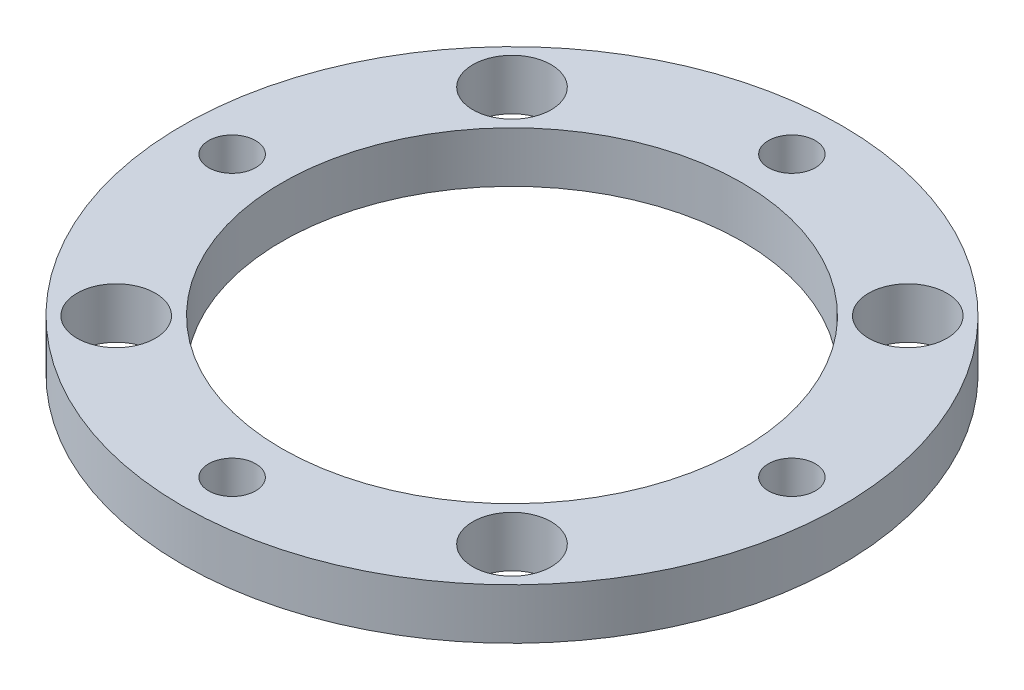
ISO-10303-21;
HEADER;
FILE_DESCRIPTION(('STEP AP214'),'2;1');
FILE_NAME('part.step','',(''),(''),'','','');
FILE_SCHEMA(('AUTOMOTIVE_DESIGN { 1 0 10303 214 1 1 1 1 }'));
ENDSEC;
DATA;
#1=APPLICATION_CONTEXT('core data for automotive mechanical design processes');
#2=APPLICATION_PROTOCOL_DEFINITION('international standard','automotive_design',2000,#1);
#3=PRODUCT_CONTEXT('',#1,'mechanical');
#4=PRODUCT('Part','Part','',(#3));
#5=PRODUCT_RELATED_PRODUCT_CATEGORY('part','',(#4));
#6=PRODUCT_DEFINITION_FORMATION('','',#4);
#7=PRODUCT_DEFINITION_CONTEXT('part definition',#1,'design');
#8=PRODUCT_DEFINITION('design','',#6,#7);
#9=PRODUCT_DEFINITION_SHAPE('','',#8);
#10=(LENGTH_UNIT() NAMED_UNIT(*) SI_UNIT(.MILLI.,.METRE.));
#11=(NAMED_UNIT(*) PLANE_ANGLE_UNIT() SI_UNIT($,.RADIAN.));
#12=(NAMED_UNIT(*) SI_UNIT($,.STERADIAN.) SOLID_ANGLE_UNIT());
#13=UNCERTAINTY_MEASURE_WITH_UNIT(LENGTH_MEASURE(1.E-05),#10,'distance_accuracy_value','');
#14=(GEOMETRIC_REPRESENTATION_CONTEXT(3) GLOBAL_UNCERTAINTY_ASSIGNED_CONTEXT((#13)) GLOBAL_UNIT_ASSIGNED_CONTEXT((#10,
#11,#12)) REPRESENTATION_CONTEXT('',''));
#15=CARTESIAN_POINT('',(0.,0.,0.));
#16=DIRECTION('',(0.,0.,1.));
#17=DIRECTION('',(1.,0.,0.));
#18=AXIS2_PLACEMENT_3D('',#15,#16,#17);
#19=CARTESIAN_POINT('',(0.,3.175,0.));
#20=DIRECTION('',(0.,-1.,0.));
#21=DIRECTION('',(0.,0.,-1.));
#22=AXIS2_PLACEMENT_3D('',#19,#20,#21);
#23=CYLINDRICAL_SURFACE('',#22,20.6375);
#24=CARTESIAN_POINT('',(0.,3.175,0.));
#25=DIRECTION('',(0.,1.,0.));
#26=DIRECTION('',(0.,0.,1.));
#27=AXIS2_PLACEMENT_3D('',#24,#25,#26);
#28=CIRCLE('',#27,20.6375);
#29=CARTESIAN_POINT('',(0.,3.175,20.6375));
#30=VERTEX_POINT('',#29);
#31=EDGE_CURVE('E10',#30,#30,#28,.T.);
#32=ORIENTED_EDGE('',*,*,#31,.F.);
#33=EDGE_LOOP('',(#32));
#34=FACE_BOUND('',#33,.T.);
#35=CARTESIAN_POINT('',(0.,0.,0.));
#36=DIRECTION('',(0.,1.,0.));
#37=DIRECTION('',(0.,0.,1.));
#38=AXIS2_PLACEMENT_3D('',#35,#36,#37);
#39=CIRCLE('',#38,20.6375);
#40=CARTESIAN_POINT('',(0.,0.,20.6375));
#41=VERTEX_POINT('',#40);
#42=EDGE_CURVE('E34',#41,#41,#39,.T.);
#43=ORIENTED_EDGE('',*,*,#42,.T.);
#44=EDGE_LOOP('',(#43));
#45=FACE_BOUND('',#44,.T.);
#46=ADVANCED_FACE('F31',(#34,#45),#23,.T.);
#47=CARTESIAN_POINT('',(0.,3.175,0.));
#48=DIRECTION('',(0.,1.,0.));
#49=DIRECTION('',(0.,0.,1.));
#50=AXIS2_PLACEMENT_3D('',#47,#48,#49);
#51=PLANE('',#50);
#52=CARTESIAN_POINT('',(-12.3927534470753,3.175,12.3927534470755));
#53=DIRECTION('',(0.,-1.,0.));
#54=DIRECTION('',(0.,0.,-1.));
#55=AXIS2_PLACEMENT_3D('',#52,#53,#54);
#56=CIRCLE('',#55,2.4511);
#57=CARTESIAN_POINT('',(-12.3927534470753,3.175,9.94165344707553));
#58=VERTEX_POINT('',#57);
#59=EDGE_CURVE('E88',#58,#58,#56,.T.);
#60=ORIENTED_EDGE('',*,*,#59,.T.);
#61=EDGE_LOOP('',(#60));
#62=FACE_BOUND('',#61,.T.);
#63=CARTESIAN_POINT('',(-12.3927534470755,3.175,-12.3927534470754));
#64=DIRECTION('',(0.,-1.,0.));
#65=DIRECTION('',(0.,0.,-1.));
#66=AXIS2_PLACEMENT_3D('',#63,#64,#65);
#67=CIRCLE('',#66,2.4511);
#68=CARTESIAN_POINT('',(-12.3927534470755,3.175,-14.8438534470754));
#69=VERTEX_POINT('',#68);
#70=EDGE_CURVE('E82',#69,#69,#67,.T.);
#71=ORIENTED_EDGE('',*,*,#70,.T.);
#72=EDGE_LOOP('',(#71));
#73=FACE_BOUND('',#72,.T.);
#74=CARTESIAN_POINT('',(12.3927534470754,3.175,-12.3927534470754));
#75=DIRECTION('',(0.,-1.,0.));
#76=DIRECTION('',(0.,0.,-1.));
#77=AXIS2_PLACEMENT_3D('',#74,#75,#76);
#78=CIRCLE('',#77,2.4511);
#79=CARTESIAN_POINT('',(12.3927534470754,3.175,-14.8438534470754));
#80=VERTEX_POINT('',#79);
#81=EDGE_CURVE('E76',#80,#80,#78,.T.);
#82=ORIENTED_EDGE('',*,*,#81,.T.);
#83=EDGE_LOOP('',(#82));
#84=FACE_BOUND('',#83,.T.);
#85=CARTESIAN_POINT('',(12.3927534470754,3.175,12.3927534470755));
#86=DIRECTION('',(0.,-1.,0.));
#87=DIRECTION('',(0.,0.,-1.));
#88=AXIS2_PLACEMENT_3D('',#85,#86,#87);
#89=CIRCLE('',#88,2.4511);
#90=CARTESIAN_POINT('',(12.3927534470754,3.175,9.94165344707546));
#91=VERTEX_POINT('',#90);
#92=EDGE_CURVE('E70',#91,#91,#89,.T.);
#93=ORIENTED_EDGE('',*,*,#92,.T.);
#94=EDGE_LOOP('',(#93));
#95=FACE_BOUND('',#94,.T.);
#96=CARTESIAN_POINT('',(-17.5259999999995,3.175,-4.98118879477261E-13));
#97=DIRECTION('',(0.,-1.,0.));
#98=DIRECTION('',(0.,0.,-1.));
#99=AXIS2_PLACEMENT_3D('',#96,#97,#98);
#100=CIRCLE('',#99,1.4732000000008);
#101=CARTESIAN_POINT('',(-17.5259999999995,3.175,-1.4732000000013));
#102=VERTEX_POINT('',#101);
#103=EDGE_CURVE('E64',#102,#102,#100,.T.);
#104=ORIENTED_EDGE('',*,*,#103,.T.);
#105=EDGE_LOOP('',(#104));
#106=FACE_BOUND('',#105,.T.);
#107=CARTESIAN_POINT('',(9.9194512699415E-13,3.175,-17.526));
#108=DIRECTION('',(0.,-1.,0.));
#109=DIRECTION('',(0.,0.,-1.));
#110=AXIS2_PLACEMENT_3D('',#107,#108,#109);
#111=CIRCLE('',#110,1.47320000000107);
#112=CARTESIAN_POINT('',(9.9194512699415E-13,3.175,-18.9992000000011));
#113=VERTEX_POINT('',#112);
#114=EDGE_CURVE('E58',#113,#113,#111,.T.);
#115=ORIENTED_EDGE('',*,*,#114,.T.);
#116=EDGE_LOOP('',(#115));
#117=FACE_BOUND('',#116,.T.);
#118=CARTESIAN_POINT('',(17.5260000000005,3.175,4.95972563497075E-13));
#119=DIRECTION('',(0.,-1.,0.));
#120=DIRECTION('',(0.,0.,-1.));
#121=AXIS2_PLACEMENT_3D('',#118,#119,#120);
#122=CIRCLE('',#121,1.47320000000039);
#123=CARTESIAN_POINT('',(17.5260000000005,3.175,-1.47319999999989));
#124=VERTEX_POINT('',#123);
#125=EDGE_CURVE('E52',#124,#124,#122,.T.);
#126=ORIENTED_EDGE('',*,*,#125,.T.);
#127=EDGE_LOOP('',(#126));
#128=FACE_BOUND('',#127,.T.);
#129=CARTESIAN_POINT('',(0.,3.175,17.526));
#130=DIRECTION('',(0.,-1.,0.));
#131=DIRECTION('',(0.,0.,-1.));
#132=AXIS2_PLACEMENT_3D('',#129,#130,#131);
#133=CIRCLE('',#132,1.4732);
#134=CARTESIAN_POINT('',(0.,3.175,16.0528));
#135=VERTEX_POINT('',#134);
#136=EDGE_CURVE('E46',#135,#135,#133,.T.);
#137=ORIENTED_EDGE('',*,*,#136,.T.);
#138=EDGE_LOOP('',(#137));
#139=FACE_BOUND('',#138,.T.);
#140=CARTESIAN_POINT('',(0.,3.175,0.));
#141=DIRECTION('',(0.,-1.,0.));
#142=DIRECTION('',(0.,0.,-1.));
#143=AXIS2_PLACEMENT_3D('',#140,#141,#142);
#144=CIRCLE('',#143,14.4145);
#145=CARTESIAN_POINT('',(0.,3.175,-14.4145));
#146=VERTEX_POINT('',#145);
#147=EDGE_CURVE('E41',#146,#146,#144,.T.);
#148=ORIENTED_EDGE('',*,*,#147,.T.);
#149=EDGE_LOOP('',(#148));
#150=FACE_BOUND('',#149,.T.);
#151=ORIENTED_EDGE('',*,*,#31,.T.);
#152=EDGE_LOOP('',(#151));
#153=FACE_BOUND('',#152,.T.);
#154=ADVANCED_FACE('F97',(#62,#73,#84,#95,#106,#117,#128,#139,#150,#153),#51,.T.);
#155=CARTESIAN_POINT('',(0.,0.,0.));
#156=DIRECTION('',(0.,1.,0.));
#157=DIRECTION('',(0.,0.,1.));
#158=AXIS2_PLACEMENT_3D('',#155,#156,#157);
#159=PLANE('',#158);
#160=CARTESIAN_POINT('',(-12.3927534470753,0.,12.3927534470755));
#161=DIRECTION('',(0.,-1.,0.));
#162=DIRECTION('',(0.,0.,-1.));
#163=AXIS2_PLACEMENT_3D('',#160,#161,#162);
#164=CIRCLE('',#163,2.4511);
#165=CARTESIAN_POINT('',(-12.3927534470753,0.,9.94165344707553));
#166=VERTEX_POINT('',#165);
#167=EDGE_CURVE('E91',#166,#166,#164,.T.);
#168=ORIENTED_EDGE('',*,*,#167,.F.);
#169=EDGE_LOOP('',(#168));
#170=FACE_BOUND('',#169,.T.);
#171=CARTESIAN_POINT('',(-12.3927534470755,0.,-12.3927534470754));
#172=DIRECTION('',(0.,-1.,0.));
#173=DIRECTION('',(0.,0.,-1.));
#174=AXIS2_PLACEMENT_3D('',#171,#172,#173);
#175=CIRCLE('',#174,2.4511);
#176=CARTESIAN_POINT('',(-12.3927534470755,0.,-14.8438534470754));
#177=VERTEX_POINT('',#176);
#178=EDGE_CURVE('E85',#177,#177,#175,.T.);
#179=ORIENTED_EDGE('',*,*,#178,.F.);
#180=EDGE_LOOP('',(#179));
#181=FACE_BOUND('',#180,.T.);
#182=CARTESIAN_POINT('',(12.3927534470754,0.,-12.3927534470754));
#183=DIRECTION('',(0.,-1.,0.));
#184=DIRECTION('',(0.,0.,-1.));
#185=AXIS2_PLACEMENT_3D('',#182,#183,#184);
#186=CIRCLE('',#185,2.4511);
#187=CARTESIAN_POINT('',(12.3927534470754,0.,-14.8438534470754));
#188=VERTEX_POINT('',#187);
#189=EDGE_CURVE('E79',#188,#188,#186,.T.);
#190=ORIENTED_EDGE('',*,*,#189,.F.);
#191=EDGE_LOOP('',(#190));
#192=FACE_BOUND('',#191,.T.);
#193=CARTESIAN_POINT('',(12.3927534470754,0.,12.3927534470755));
#194=DIRECTION('',(0.,-1.,0.));
#195=DIRECTION('',(0.,0.,-1.));
#196=AXIS2_PLACEMENT_3D('',#193,#194,#195);
#197=CIRCLE('',#196,2.4511);
#198=CARTESIAN_POINT('',(12.3927534470754,0.,9.94165344707546));
#199=VERTEX_POINT('',#198);
#200=EDGE_CURVE('E73',#199,#199,#197,.T.);
#201=ORIENTED_EDGE('',*,*,#200,.F.);
#202=EDGE_LOOP('',(#201));
#203=FACE_BOUND('',#202,.T.);
#204=CARTESIAN_POINT('',(-17.5259999999995,0.,-4.98118879477261E-13));
#205=DIRECTION('',(0.,-1.,0.));
#206=DIRECTION('',(0.,0.,-1.));
#207=AXIS2_PLACEMENT_3D('',#204,#205,#206);
#208=CIRCLE('',#207,1.4732000000008);
#209=CARTESIAN_POINT('',(-17.5259999999995,0.,-1.4732000000013));
#210=VERTEX_POINT('',#209);
#211=EDGE_CURVE('E67',#210,#210,#208,.T.);
#212=ORIENTED_EDGE('',*,*,#211,.F.);
#213=EDGE_LOOP('',(#212));
#214=FACE_BOUND('',#213,.T.);
#215=CARTESIAN_POINT('',(9.9194512699415E-13,0.,-17.526));
#216=DIRECTION('',(0.,-1.,0.));
#217=DIRECTION('',(0.,0.,-1.));
#218=AXIS2_PLACEMENT_3D('',#215,#216,#217);
#219=CIRCLE('',#218,1.47320000000107);
#220=CARTESIAN_POINT('',(9.9194512699415E-13,0.,-18.9992000000011));
#221=VERTEX_POINT('',#220);
#222=EDGE_CURVE('E61',#221,#221,#219,.T.);
#223=ORIENTED_EDGE('',*,*,#222,.F.);
#224=EDGE_LOOP('',(#223));
#225=FACE_BOUND('',#224,.T.);
#226=CARTESIAN_POINT('',(17.5260000000005,0.,4.95972563497075E-13));
#227=DIRECTION('',(0.,-1.,0.));
#228=DIRECTION('',(0.,0.,-1.));
#229=AXIS2_PLACEMENT_3D('',#226,#227,#228);
#230=CIRCLE('',#229,1.47320000000039);
#231=CARTESIAN_POINT('',(17.5260000000005,0.,-1.47319999999989));
#232=VERTEX_POINT('',#231);
#233=EDGE_CURVE('E55',#232,#232,#230,.T.);
#234=ORIENTED_EDGE('',*,*,#233,.F.);
#235=EDGE_LOOP('',(#234));
#236=FACE_BOUND('',#235,.T.);
#237=CARTESIAN_POINT('',(0.,0.,17.526));
#238=DIRECTION('',(0.,-1.,0.));
#239=DIRECTION('',(0.,0.,-1.));
#240=AXIS2_PLACEMENT_3D('',#237,#238,#239);
#241=CIRCLE('',#240,1.4732);
#242=CARTESIAN_POINT('',(0.,0.,16.0528));
#243=VERTEX_POINT('',#242);
#244=EDGE_CURVE('E49',#243,#243,#241,.T.);
#245=ORIENTED_EDGE('',*,*,#244,.F.);
#246=EDGE_LOOP('',(#245));
#247=FACE_BOUND('',#246,.T.);
#248=CARTESIAN_POINT('',(0.,0.,0.));
#249=DIRECTION('',(0.,-1.,0.));
#250=DIRECTION('',(0.,0.,-1.));
#251=AXIS2_PLACEMENT_3D('',#248,#249,#250);
#252=CIRCLE('',#251,14.4145);
#253=CARTESIAN_POINT('',(0.,0.,-14.4145));
#254=VERTEX_POINT('',#253);
#255=EDGE_CURVE('E43',#254,#254,#252,.T.);
#256=ORIENTED_EDGE('',*,*,#255,.F.);
#257=EDGE_LOOP('',(#256));
#258=FACE_BOUND('',#257,.T.);
#259=ORIENTED_EDGE('',*,*,#42,.F.);
#260=EDGE_LOOP('',(#259));
#261=FACE_BOUND('',#260,.T.);
#262=ADVANCED_FACE('F107',(#170,#181,#192,#203,#214,#225,#236,#247,#258,#261),#159,.F.);
#263=CARTESIAN_POINT('',(0.,3.175,0.));
#264=DIRECTION('',(0.,-1.,0.));
#265=DIRECTION('',(0.,0.,-1.));
#266=AXIS2_PLACEMENT_3D('',#263,#264,#265);
#267=CYLINDRICAL_SURFACE('',#266,14.4145);
#268=ORIENTED_EDGE('',*,*,#147,.F.);
#269=EDGE_LOOP('',(#268));
#270=FACE_BOUND('',#269,.T.);
#271=ORIENTED_EDGE('',*,*,#255,.T.);
#272=EDGE_LOOP('',(#271));
#273=FACE_BOUND('',#272,.T.);
#274=ADVANCED_FACE('F110',(#270,#273),#267,.F.);
#275=CARTESIAN_POINT('',(0.,3.175,17.526));
#276=DIRECTION('',(0.,-1.,0.));
#277=DIRECTION('',(0.,0.,-1.));
#278=AXIS2_PLACEMENT_3D('',#275,#276,#277);
#279=CYLINDRICAL_SURFACE('',#278,1.4732);
#280=ORIENTED_EDGE('',*,*,#136,.F.);
#281=EDGE_LOOP('',(#280));
#282=FACE_BOUND('',#281,.T.);
#283=ORIENTED_EDGE('',*,*,#244,.T.);
#284=EDGE_LOOP('',(#283));
#285=FACE_BOUND('',#284,.T.);
#286=ADVANCED_FACE('F140',(#282,#285),#279,.F.);
#287=CARTESIAN_POINT('',(17.5260000000005,3.175,4.95972563497075E-13));
#288=DIRECTION('',(0.,-1.,0.));
#289=DIRECTION('',(0.,0.,-1.));
#290=AXIS2_PLACEMENT_3D('',#287,#288,#289);
#291=CYLINDRICAL_SURFACE('',#290,1.47320000000039);
#292=ORIENTED_EDGE('',*,*,#125,.F.);
#293=EDGE_LOOP('',(#292));
#294=FACE_BOUND('',#293,.T.);
#295=ORIENTED_EDGE('',*,*,#233,.T.);
#296=EDGE_LOOP('',(#295));
#297=FACE_BOUND('',#296,.T.);
#298=ADVANCED_FACE('F144',(#294,#297),#291,.F.);
#299=CARTESIAN_POINT('',(9.9194512699415E-13,3.175,-17.526));
#300=DIRECTION('',(0.,-1.,0.));
#301=DIRECTION('',(0.,0.,-1.));
#302=AXIS2_PLACEMENT_3D('',#299,#300,#301);
#303=CYLINDRICAL_SURFACE('',#302,1.47320000000107);
#304=ORIENTED_EDGE('',*,*,#114,.F.);
#305=EDGE_LOOP('',(#304));
#306=FACE_BOUND('',#305,.T.);
#307=ORIENTED_EDGE('',*,*,#222,.T.);
#308=EDGE_LOOP('',(#307));
#309=FACE_BOUND('',#308,.T.);
#310=ADVANCED_FACE('F148',(#306,#309),#303,.F.);
#311=CARTESIAN_POINT('',(-17.5259999999995,3.175,-4.98118879477261E-13));
#312=DIRECTION('',(0.,-1.,0.));
#313=DIRECTION('',(0.,0.,-1.));
#314=AXIS2_PLACEMENT_3D('',#311,#312,#313);
#315=CYLINDRICAL_SURFACE('',#314,1.4732000000008);
#316=ORIENTED_EDGE('',*,*,#103,.F.);
#317=EDGE_LOOP('',(#316));
#318=FACE_BOUND('',#317,.T.);
#319=ORIENTED_EDGE('',*,*,#211,.T.);
#320=EDGE_LOOP('',(#319));
#321=FACE_BOUND('',#320,.T.);
#322=ADVANCED_FACE('F152',(#318,#321),#315,.F.);
#323=CARTESIAN_POINT('',(12.3927534470754,3.175,12.3927534470755));
#324=DIRECTION('',(0.,-1.,0.));
#325=DIRECTION('',(0.,0.,-1.));
#326=AXIS2_PLACEMENT_3D('',#323,#324,#325);
#327=CYLINDRICAL_SURFACE('',#326,2.4511);
#328=ORIENTED_EDGE('',*,*,#92,.F.);
#329=EDGE_LOOP('',(#328));
#330=FACE_BOUND('',#329,.T.);
#331=ORIENTED_EDGE('',*,*,#200,.T.);
#332=EDGE_LOOP('',(#331));
#333=FACE_BOUND('',#332,.T.);
#334=ADVANCED_FACE('F156',(#330,#333),#327,.F.);
#335=CARTESIAN_POINT('',(12.3927534470754,3.175,-12.3927534470754));
#336=DIRECTION('',(0.,-1.,0.));
#337=DIRECTION('',(0.,0.,-1.));
#338=AXIS2_PLACEMENT_3D('',#335,#336,#337);
#339=CYLINDRICAL_SURFACE('',#338,2.4511);
#340=ORIENTED_EDGE('',*,*,#81,.F.);
#341=EDGE_LOOP('',(#340));
#342=FACE_BOUND('',#341,.T.);
#343=ORIENTED_EDGE('',*,*,#189,.T.);
#344=EDGE_LOOP('',(#343));
#345=FACE_BOUND('',#344,.T.);
#346=ADVANCED_FACE('F160',(#342,#345),#339,.F.);
#347=CARTESIAN_POINT('',(-12.3927534470755,3.175,-12.3927534470754));
#348=DIRECTION('',(0.,-1.,0.));
#349=DIRECTION('',(0.,0.,-1.));
#350=AXIS2_PLACEMENT_3D('',#347,#348,#349);
#351=CYLINDRICAL_SURFACE('',#350,2.4511);
#352=ORIENTED_EDGE('',*,*,#70,.F.);
#353=EDGE_LOOP('',(#352));
#354=FACE_BOUND('',#353,.T.);
#355=ORIENTED_EDGE('',*,*,#178,.T.);
#356=EDGE_LOOP('',(#355));
#357=FACE_BOUND('',#356,.T.);
#358=ADVANCED_FACE('F103',(#354,#357),#351,.F.);
#359=CARTESIAN_POINT('',(-12.3927534470753,3.175,12.3927534470755));
#360=DIRECTION('',(0.,-1.,0.));
#361=DIRECTION('',(0.,0.,-1.));
#362=AXIS2_PLACEMENT_3D('',#359,#360,#361);
#363=CYLINDRICAL_SURFACE('',#362,2.4511);
#364=ORIENTED_EDGE('',*,*,#59,.F.);
#365=EDGE_LOOP('',(#364));
#366=FACE_BOUND('',#365,.T.);
#367=ORIENTED_EDGE('',*,*,#167,.T.);
#368=EDGE_LOOP('',(#367));
#369=FACE_BOUND('',#368,.T.);
#370=ADVANCED_FACE('F100',(#366,#369),#363,.F.);
#371=CLOSED_SHELL('',(#46,#154,#262,#274,#286,#298,#310,#322,#334,#346,#358,#370));
#372=MANIFOLD_SOLID_BREP('B2',#371);
#373=ADVANCED_BREP_SHAPE_REPRESENTATION('',(#18,#372),#14);
#374=SHAPE_DEFINITION_REPRESENTATION(#9,#373);
ENDSEC;
END-ISO-10303-21;
